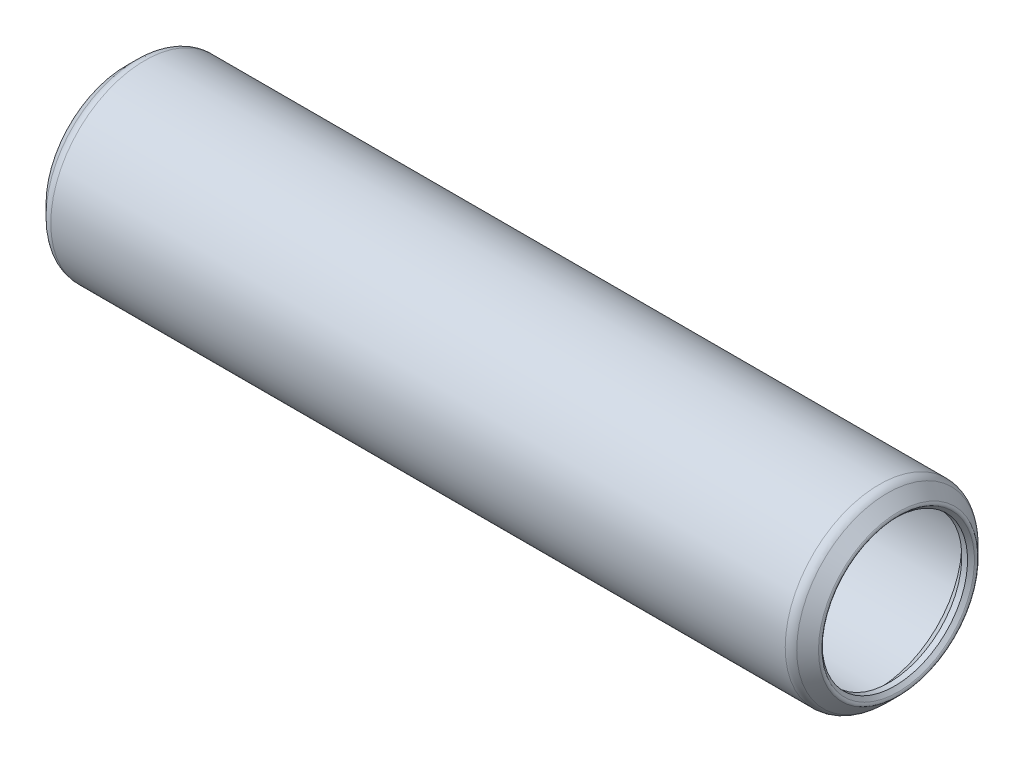
ISO-10303-21;
HEADER;
FILE_DESCRIPTION(('STEP AP214'),'2;1');
FILE_NAME('part.step','',(''),(''),'','','');
FILE_SCHEMA(('AUTOMOTIVE_DESIGN { 1 0 10303 214 1 1 1 1 }'));
ENDSEC;
DATA;
#1=APPLICATION_CONTEXT('core data for automotive mechanical design processes');
#2=APPLICATION_PROTOCOL_DEFINITION('international standard','automotive_design',2000,#1);
#3=PRODUCT_CONTEXT('',#1,'mechanical');
#4=PRODUCT('Part','Part','',(#3));
#5=PRODUCT_RELATED_PRODUCT_CATEGORY('part','',(#4));
#6=PRODUCT_DEFINITION_FORMATION('','',#4);
#7=PRODUCT_DEFINITION_CONTEXT('part definition',#1,'design');
#8=PRODUCT_DEFINITION('design','',#6,#7);
#9=PRODUCT_DEFINITION_SHAPE('','',#8);
#10=(LENGTH_UNIT() NAMED_UNIT(*) SI_UNIT(.MILLI.,.METRE.));
#11=(NAMED_UNIT(*) PLANE_ANGLE_UNIT() SI_UNIT($,.RADIAN.));
#12=(NAMED_UNIT(*) SI_UNIT($,.STERADIAN.) SOLID_ANGLE_UNIT());
#13=UNCERTAINTY_MEASURE_WITH_UNIT(LENGTH_MEASURE(1.E-05),#10,'distance_accuracy_value','');
#14=(GEOMETRIC_REPRESENTATION_CONTEXT(3) GLOBAL_UNCERTAINTY_ASSIGNED_CONTEXT((#13)) GLOBAL_UNIT_ASSIGNED_CONTEXT((#10,
#11,#12)) REPRESENTATION_CONTEXT('',''));
#15=CARTESIAN_POINT('',(0.,0.,0.));
#16=DIRECTION('',(0.,0.,1.));
#17=DIRECTION('',(1.,0.,0.));
#18=AXIS2_PLACEMENT_3D('',#15,#16,#17);
#19=CARTESIAN_POINT('',(-0.355226146905763,0.,0.));
#20=DIRECTION('',(-1.,0.,0.));
#21=DIRECTION('',(0.,0.,1.));
#22=AXIS2_PLACEMENT_3D('',#19,#20,#21);
#23=TOROIDAL_SURFACE('',#22,3.77968126932705,0.126999999999896);
#24=CARTESIAN_POINT('',(-0.44502870811635,0.,0.));
#25=DIRECTION('',(-1.,0.,0.));
#26=DIRECTION('',(0.,0.,1.));
#27=AXIS2_PLACEMENT_3D('',#24,#25,#26);
#28=CIRCLE('',#27,3.6898787081164);
#29=CARTESIAN_POINT('',(-0.44502870811635,0.,3.6898787081164));
#30=VERTEX_POINT('',#29);
#31=EDGE_CURVE('E10',#30,#30,#28,.T.);
#32=ORIENTED_EDGE('',*,*,#31,.F.);
#33=EDGE_LOOP('',(#32));
#34=FACE_BOUND('',#33,.T.);
#35=CARTESIAN_POINT('',(-0.44502870811635,0.,0.));
#36=DIRECTION('',(-1.,0.,0.));
#37=DIRECTION('',(0.,0.,1.));
#38=AXIS2_PLACEMENT_3D('',#35,#36,#37);
#39=CIRCLE('',#38,3.8694838305377);
#40=CARTESIAN_POINT('',(-0.44502870811635,0.,3.8694838305377));
#41=VERTEX_POINT('',#40);
#42=EDGE_CURVE('E79',#41,#41,#39,.T.);
#43=ORIENTED_EDGE('',*,*,#42,.T.);
#44=EDGE_LOOP('',(#43));
#45=FACE_BOUND('',#44,.T.);
#46=ADVANCED_FACE('F33',(#34,#45),#23,.T.);
#47=CARTESIAN_POINT('',(-0.44502870811635,0.,0.));
#48=DIRECTION('',(-1.,0.,0.));
#49=DIRECTION('',(0.,0.,1.));
#50=AXIS2_PLACEMENT_3D('',#47,#48,#49);
#51=CONICAL_SURFACE('',#50,3.6898787081164,0.785398163397595);
#52=CARTESIAN_POINT('',(-0.279399999999999,0.,0.));
#53=DIRECTION('',(-1.,0.,0.));
#54=DIRECTION('',(0.,0.,1.));
#55=AXIS2_PLACEMENT_3D('',#52,#53,#54);
#56=CIRCLE('',#55,3.52425);
#57=CARTESIAN_POINT('',(-0.279399999999999,0.,3.52425));
#58=VERTEX_POINT('',#57);
#59=EDGE_CURVE('E39',#58,#58,#56,.T.);
#60=ORIENTED_EDGE('',*,*,#59,.F.);
#61=EDGE_LOOP('',(#60));
#62=FACE_BOUND('',#61,.T.);
#63=ORIENTED_EDGE('',*,*,#31,.T.);
#64=EDGE_LOOP('',(#63));
#65=FACE_BOUND('',#64,.T.);
#66=ADVANCED_FACE('F152',(#62,#65),#51,.F.);
#67=CARTESIAN_POINT('',(36.5506,0.,0.));
#68=DIRECTION('',(-1.,0.,0.));
#69=DIRECTION('',(0.,0.,1.));
#70=AXIS2_PLACEMENT_3D('',#67,#68,#69);
#71=CYLINDRICAL_SURFACE('',#70,3.52425);
#72=CARTESIAN_POINT('',(0.,0.,0.));
#73=DIRECTION('',(-1.,0.,0.));
#74=DIRECTION('',(0.,0.,1.));
#75=AXIS2_PLACEMENT_3D('',#72,#73,#74);
#76=CIRCLE('',#75,3.52425);
#77=CARTESIAN_POINT('',(0.,0.,3.52425));
#78=VERTEX_POINT('',#77);
#79=EDGE_CURVE('E43',#78,#78,#76,.T.);
#80=ORIENTED_EDGE('',*,*,#79,.F.);
#81=EDGE_LOOP('',(#80));
#82=FACE_BOUND('',#81,.T.);
#83=ORIENTED_EDGE('',*,*,#59,.T.);
#84=EDGE_LOOP('',(#83));
#85=FACE_BOUND('',#84,.T.);
#86=ADVANCED_FACE('F147',(#82,#85),#71,.F.);
#87=CARTESIAN_POINT('',(0.,0.,0.));
#88=DIRECTION('',(1.,0.,0.));
#89=DIRECTION('',(0.,0.,-1.));
#90=AXIS2_PLACEMENT_3D('',#87,#88,#89);
#91=CONICAL_SURFACE('',#90,3.52425,0.78539816339745);
#92=CARTESIAN_POINT('',(0.558799999999998,0.,0.));
#93=DIRECTION('',(-1.,0.,0.));
#94=DIRECTION('',(0.,0.,1.));
#95=AXIS2_PLACEMENT_3D('',#92,#93,#94);
#96=CIRCLE('',#95,4.08305);
#97=CARTESIAN_POINT('',(0.558799999999998,0.,4.08305));
#98=VERTEX_POINT('',#97);
#99=EDGE_CURVE('E47',#98,#98,#96,.T.);
#100=ORIENTED_EDGE('',*,*,#99,.F.);
#101=EDGE_LOOP('',(#100));
#102=FACE_BOUND('',#101,.T.);
#103=ORIENTED_EDGE('',*,*,#79,.T.);
#104=EDGE_LOOP('',(#103));
#105=FACE_BOUND('',#104,.T.);
#106=ADVANCED_FACE('F141',(#102,#105),#91,.F.);
#107=CARTESIAN_POINT('',(36.5506,0.,0.));
#108=DIRECTION('',(-1.,0.,0.));
#109=DIRECTION('',(0.,0.,1.));
#110=AXIS2_PLACEMENT_3D('',#107,#108,#109);
#111=CYLINDRICAL_SURFACE('',#110,4.08305);
#112=CARTESIAN_POINT('',(35.9918,0.,0.));
#113=DIRECTION('',(-1.,0.,0.));
#114=DIRECTION('',(0.,0.,1.));
#115=AXIS2_PLACEMENT_3D('',#112,#113,#114);
#116=CIRCLE('',#115,4.08305);
#117=CARTESIAN_POINT('',(35.9918,0.,4.08305));
#118=VERTEX_POINT('',#117);
#119=EDGE_CURVE('E52',#118,#118,#116,.T.);
#120=ORIENTED_EDGE('',*,*,#119,.F.);
#121=EDGE_LOOP('',(#120));
#122=FACE_BOUND('',#121,.T.);
#123=ORIENTED_EDGE('',*,*,#99,.T.);
#124=EDGE_LOOP('',(#123));
#125=FACE_BOUND('',#124,.T.);
#126=ADVANCED_FACE('F135',(#122,#125),#111,.F.);
#127=CARTESIAN_POINT('',(35.9918,0.,0.));
#128=DIRECTION('',(-1.,0.,0.));
#129=DIRECTION('',(0.,0.,1.));
#130=AXIS2_PLACEMENT_3D('',#127,#128,#129);
#131=CONICAL_SURFACE('',#130,4.08305,0.785398163397444);
#132=CARTESIAN_POINT('',(36.5506,0.,0.));
#133=DIRECTION('',(-1.,0.,0.));
#134=DIRECTION('',(0.,0.,1.));
#135=AXIS2_PLACEMENT_3D('',#132,#133,#134);
#136=CIRCLE('',#135,3.52425);
#137=CARTESIAN_POINT('',(36.5506,0.,3.52425));
#138=VERTEX_POINT('',#137);
#139=EDGE_CURVE('E55',#138,#138,#136,.T.);
#140=ORIENTED_EDGE('',*,*,#139,.F.);
#141=EDGE_LOOP('',(#140));
#142=FACE_BOUND('',#141,.T.);
#143=ORIENTED_EDGE('',*,*,#119,.T.);
#144=EDGE_LOOP('',(#143));
#145=FACE_BOUND('',#144,.T.);
#146=ADVANCED_FACE('F129',(#142,#145),#131,.F.);
#147=CARTESIAN_POINT('',(36.5506,0.,0.));
#148=DIRECTION('',(-1.,0.,0.));
#149=DIRECTION('',(0.,0.,1.));
#150=AXIS2_PLACEMENT_3D('',#147,#148,#149);
#151=CYLINDRICAL_SURFACE('',#150,3.52425);
#152=CARTESIAN_POINT('',(36.83,0.,0.));
#153=DIRECTION('',(-1.,0.,0.));
#154=DIRECTION('',(0.,0.,1.));
#155=AXIS2_PLACEMENT_3D('',#152,#153,#154);
#156=CIRCLE('',#155,3.52425);
#157=CARTESIAN_POINT('',(36.83,0.,3.52425));
#158=VERTEX_POINT('',#157);
#159=EDGE_CURVE('E58',#158,#158,#156,.T.);
#160=ORIENTED_EDGE('',*,*,#159,.F.);
#161=EDGE_LOOP('',(#160));
#162=FACE_BOUND('',#161,.T.);
#163=ORIENTED_EDGE('',*,*,#139,.T.);
#164=EDGE_LOOP('',(#163));
#165=FACE_BOUND('',#164,.T.);
#166=ADVANCED_FACE('F123',(#162,#165),#151,.F.);
#167=CARTESIAN_POINT('',(36.83,0.,0.));
#168=DIRECTION('',(1.,0.,0.));
#169=DIRECTION('',(0.,0.,-1.));
#170=AXIS2_PLACEMENT_3D('',#167,#168,#169);
#171=CONICAL_SURFACE('',#170,3.52425,0.785398163397451);
#172=CARTESIAN_POINT('',(36.9956287081175,0.,0.));
#173=DIRECTION('',(-1.,0.,0.));
#174=DIRECTION('',(0.,0.,1.));
#175=AXIS2_PLACEMENT_3D('',#172,#173,#174);
#176=CIRCLE('',#175,3.68987870811748);
#177=CARTESIAN_POINT('',(36.9956287081175,0.,3.68987870811748));
#178=VERTEX_POINT('',#177);
#179=EDGE_CURVE('E61',#178,#178,#176,.T.);
#180=ORIENTED_EDGE('',*,*,#179,.F.);
#181=EDGE_LOOP('',(#180));
#182=FACE_BOUND('',#181,.T.);
#183=ORIENTED_EDGE('',*,*,#159,.T.);
#184=EDGE_LOOP('',(#183));
#185=FACE_BOUND('',#184,.T.);
#186=ADVANCED_FACE('F117',(#182,#185),#171,.F.);
#187=CARTESIAN_POINT('',(36.9058261469076,0.,0.));
#188=DIRECTION('',(-1.,0.,0.));
#189=DIRECTION('',(0.,0.,1.));
#190=AXIS2_PLACEMENT_3D('',#187,#188,#189);
#191=TOROIDAL_SURFACE('',#190,3.779681269327,0.126999999998565);
#192=CARTESIAN_POINT('',(36.9956287081175,0.,0.));
#193=DIRECTION('',(-1.,0.,0.));
#194=DIRECTION('',(0.,0.,1.));
#195=AXIS2_PLACEMENT_3D('',#192,#193,#194);
#196=CIRCLE('',#195,3.86948383053653);
#197=CARTESIAN_POINT('',(36.9956287081175,0.,3.86948383053653));
#198=VERTEX_POINT('',#197);
#199=EDGE_CURVE('E64',#198,#198,#196,.T.);
#200=ORIENTED_EDGE('',*,*,#199,.F.);
#201=EDGE_LOOP('',(#200));
#202=FACE_BOUND('',#201,.T.);
#203=ORIENTED_EDGE('',*,*,#179,.T.);
#204=EDGE_LOOP('',(#203));
#205=FACE_BOUND('',#204,.T.);
#206=ADVANCED_FACE('F111',(#202,#205),#191,.T.);
#207=CARTESIAN_POINT('',(36.9956287081175,0.,0.));
#208=DIRECTION('',(-1.,0.,0.));
#209=DIRECTION('',(0.,0.,1.));
#210=AXIS2_PLACEMENT_3D('',#207,#208,#209);
#211=CONICAL_SURFACE('',#210,3.86948383053653,0.785398163397453);
#212=CARTESIAN_POINT('',(36.4694812693263,0.,0.));
#213=DIRECTION('',(-1.,0.,0.));
#214=DIRECTION('',(0.,0.,1.));
#215=AXIS2_PLACEMENT_3D('',#212,#213,#214);
#216=CIRCLE('',#215,4.39563126932768);
#217=CARTESIAN_POINT('',(36.4694812693263,0.,4.39563126932768));
#218=VERTEX_POINT('',#217);
#219=EDGE_CURVE('E67',#218,#218,#216,.T.);
#220=ORIENTED_EDGE('',*,*,#219,.F.);
#221=EDGE_LOOP('',(#220));
#222=FACE_BOUND('',#221,.T.);
#223=ORIENTED_EDGE('',*,*,#199,.T.);
#224=EDGE_LOOP('',(#223));
#225=FACE_BOUND('',#224,.T.);
#226=ADVANCED_FACE('F105',(#222,#225),#211,.T.);
#227=CARTESIAN_POINT('',(36.0743500000008,0.,0.));
#228=DIRECTION('',(-1.,0.,0.));
#229=DIRECTION('',(0.,0.,1.));
#230=AXIS2_PLACEMENT_3D('',#227,#228,#229);
#231=TOROIDAL_SURFACE('',#230,4.00050000000216,0.558799999997852);
#232=CARTESIAN_POINT('',(36.0743500000008,0.,0.));
#233=DIRECTION('',(-1.,0.,0.));
#234=DIRECTION('',(0.,0.,1.));
#235=AXIS2_PLACEMENT_3D('',#232,#233,#234);
#236=CIRCLE('',#235,4.55930000000001);
#237=CARTESIAN_POINT('',(36.0743500000008,0.,4.55930000000001));
#238=VERTEX_POINT('',#237);
#239=EDGE_CURVE('E70',#238,#238,#236,.T.);
#240=ORIENTED_EDGE('',*,*,#239,.F.);
#241=EDGE_LOOP('',(#240));
#242=FACE_BOUND('',#241,.T.);
#243=ORIENTED_EDGE('',*,*,#219,.T.);
#244=EDGE_LOOP('',(#243));
#245=FACE_BOUND('',#244,.T.);
#246=ADVANCED_FACE('F99',(#242,#245),#231,.T.);
#247=CARTESIAN_POINT('',(36.5506,0.,0.));
#248=DIRECTION('',(-1.,0.,0.));
#249=DIRECTION('',(0.,0.,1.));
#250=AXIS2_PLACEMENT_3D('',#247,#248,#249);
#251=CYLINDRICAL_SURFACE('',#250,4.5593);
#252=CARTESIAN_POINT('',(0.476249999999998,0.,0.));
#253=DIRECTION('',(-1.,0.,0.));
#254=DIRECTION('',(0.,0.,1.));
#255=AXIS2_PLACEMENT_3D('',#252,#253,#254);
#256=CIRCLE('',#255,4.5593);
#257=CARTESIAN_POINT('',(0.476249999999998,0.,4.5593));
#258=VERTEX_POINT('',#257);
#259=EDGE_CURVE('E73',#258,#258,#256,.T.);
#260=ORIENTED_EDGE('',*,*,#259,.F.);
#261=EDGE_LOOP('',(#260));
#262=FACE_BOUND('',#261,.T.);
#263=ORIENTED_EDGE('',*,*,#239,.T.);
#264=EDGE_LOOP('',(#263));
#265=FACE_BOUND('',#264,.T.);
#266=ADVANCED_FACE('F93',(#262,#265),#251,.T.);
#267=CARTESIAN_POINT('',(0.476249999999998,0.,0.));
#268=DIRECTION('',(-1.,0.,0.));
#269=DIRECTION('',(0.,0.,1.));
#270=AXIS2_PLACEMENT_3D('',#267,#268,#269);
#271=TOROIDAL_SURFACE('',#270,4.00050000000011,0.558799999999892);
#272=CARTESIAN_POINT('',(0.0811187306729577,0.,0.));
#273=DIRECTION('',(-1.,0.,0.));
#274=DIRECTION('',(0.,0.,1.));
#275=AXIS2_PLACEMENT_3D('',#272,#273,#274);
#276=CIRCLE('',#275,4.395631269327);
#277=CARTESIAN_POINT('',(0.0811187306729577,0.,4.395631269327));
#278=VERTEX_POINT('',#277);
#279=EDGE_CURVE('E76',#278,#278,#276,.T.);
#280=ORIENTED_EDGE('',*,*,#279,.F.);
#281=EDGE_LOOP('',(#280));
#282=FACE_BOUND('',#281,.T.);
#283=ORIENTED_EDGE('',*,*,#259,.T.);
#284=EDGE_LOOP('',(#283));
#285=FACE_BOUND('',#284,.T.);
#286=ADVANCED_FACE('F87',(#282,#285),#271,.T.);
#287=CARTESIAN_POINT('',(0.0811187306729577,0.,0.));
#288=DIRECTION('',(1.,0.,0.));
#289=DIRECTION('',(0.,0.,-1.));
#290=AXIS2_PLACEMENT_3D('',#287,#288,#289);
#291=CONICAL_SURFACE('',#290,4.395631269327,0.78539816339744);
#292=ORIENTED_EDGE('',*,*,#42,.F.);
#293=EDGE_LOOP('',(#292));
#294=FACE_BOUND('',#293,.T.);
#295=ORIENTED_EDGE('',*,*,#279,.T.);
#296=EDGE_LOOP('',(#295));
#297=FACE_BOUND('',#296,.T.);
#298=ADVANCED_FACE('F84',(#294,#297),#291,.T.);
#299=CLOSED_SHELL('',(#46,#66,#86,#106,#126,#146,#166,#186,#206,#226,#246,#266,#286,#298));
#300=MANIFOLD_SOLID_BREP('B2',#299);
#301=ADVANCED_BREP_SHAPE_REPRESENTATION('',(#18,#300),#14);
#302=SHAPE_DEFINITION_REPRESENTATION(#9,#301);
ENDSEC;
END-ISO-10303-21;
